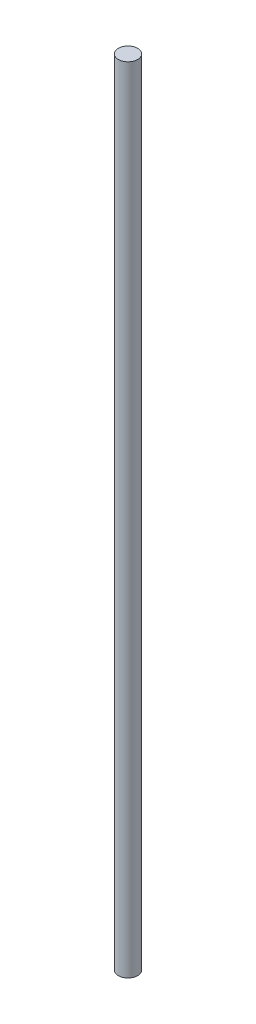
ISO-10303-21;
HEADER;
FILE_DESCRIPTION(('STEP AP214'),'2;1');
FILE_NAME('part.step','',(''),(''),'','','');
FILE_SCHEMA(('AUTOMOTIVE_DESIGN { 1 0 10303 214 1 1 1 1 }'));
ENDSEC;
DATA;
#1=APPLICATION_CONTEXT('core data for automotive mechanical design processes');
#2=APPLICATION_PROTOCOL_DEFINITION('international standard','automotive_design',2000,#1);
#3=PRODUCT_CONTEXT('',#1,'mechanical');
#4=PRODUCT('Part','Part','',(#3));
#5=PRODUCT_RELATED_PRODUCT_CATEGORY('part','',(#4));
#6=PRODUCT_DEFINITION_FORMATION('','',#4);
#7=PRODUCT_DEFINITION_CONTEXT('part definition',#1,'design');
#8=PRODUCT_DEFINITION('design','',#6,#7);
#9=PRODUCT_DEFINITION_SHAPE('','',#8);
#10=(LENGTH_UNIT() NAMED_UNIT(*) SI_UNIT(.MILLI.,.METRE.));
#11=(NAMED_UNIT(*) PLANE_ANGLE_UNIT() SI_UNIT($,.RADIAN.));
#12=(NAMED_UNIT(*) SI_UNIT($,.STERADIAN.) SOLID_ANGLE_UNIT());
#13=UNCERTAINTY_MEASURE_WITH_UNIT(LENGTH_MEASURE(1.E-05),#10,'distance_accuracy_value','');
#14=(GEOMETRIC_REPRESENTATION_CONTEXT(3) GLOBAL_UNCERTAINTY_ASSIGNED_CONTEXT((#13)) GLOBAL_UNIT_ASSIGNED_CONTEXT((#10,
#11,#12)) REPRESENTATION_CONTEXT('',''));
#15=CARTESIAN_POINT('',(0.,0.,0.));
#16=DIRECTION('',(0.,0.,1.));
#17=DIRECTION('',(1.,0.,0.));
#18=AXIS2_PLACEMENT_3D('',#15,#16,#17);
#19=CARTESIAN_POINT('',(0.,205.,0.));
#20=DIRECTION('',(0.,-1.,0.));
#21=DIRECTION('',(0.,0.,-1.));
#22=AXIS2_PLACEMENT_3D('',#19,#20,#21);
#23=CYLINDRICAL_SURFACE('',#22,2.5);
#24=CARTESIAN_POINT('',(0.,205.,0.));
#25=DIRECTION('',(0.,1.,0.));
#26=DIRECTION('',(0.,0.,1.));
#27=AXIS2_PLACEMENT_3D('',#24,#25,#26);
#28=CIRCLE('',#27,2.5);
#29=CARTESIAN_POINT('',(0.,205.,2.5));
#30=VERTEX_POINT('',#29);
#31=EDGE_CURVE('E10',#30,#30,#28,.T.);
#32=ORIENTED_EDGE('',*,*,#31,.F.);
#33=EDGE_LOOP('',(#32));
#34=FACE_BOUND('',#33,.T.);
#35=CARTESIAN_POINT('',(0.,0.,0.));
#36=DIRECTION('',(0.,1.,0.));
#37=DIRECTION('',(0.,0.,1.));
#38=AXIS2_PLACEMENT_3D('',#35,#36,#37);
#39=CIRCLE('',#38,2.5);
#40=CARTESIAN_POINT('',(0.,0.,2.5));
#41=VERTEX_POINT('',#40);
#42=EDGE_CURVE('E35',#41,#41,#39,.T.);
#43=ORIENTED_EDGE('',*,*,#42,.T.);
#44=EDGE_LOOP('',(#43));
#45=FACE_BOUND('',#44,.T.);
#46=ADVANCED_FACE('F32',(#34,#45),#23,.T.);
#47=CARTESIAN_POINT('',(0.,205.,0.));
#48=DIRECTION('',(0.,1.,0.));
#49=DIRECTION('',(0.,0.,1.));
#50=AXIS2_PLACEMENT_3D('',#47,#48,#49);
#51=PLANE('',#50);
#52=ORIENTED_EDGE('',*,*,#31,.T.);
#53=EDGE_LOOP('',(#52));
#54=FACE_BOUND('',#53,.T.);
#55=ADVANCED_FACE('F47',(#54),#51,.T.);
#56=CARTESIAN_POINT('',(0.,0.,0.));
#57=DIRECTION('',(0.,1.,0.));
#58=DIRECTION('',(0.,0.,1.));
#59=AXIS2_PLACEMENT_3D('',#56,#57,#58);
#60=PLANE('',#59);
#61=ORIENTED_EDGE('',*,*,#42,.F.);
#62=EDGE_LOOP('',(#61));
#63=FACE_BOUND('',#62,.T.);
#64=ADVANCED_FACE('F45',(#63),#60,.F.);
#65=CLOSED_SHELL('',(#46,#55,#64));
#66=MANIFOLD_SOLID_BREP('B2',#65);
#67=ADVANCED_BREP_SHAPE_REPRESENTATION('',(#18,#66),#14);
#68=SHAPE_DEFINITION_REPRESENTATION(#9,#67);
ENDSEC;
END-ISO-10303-21;
